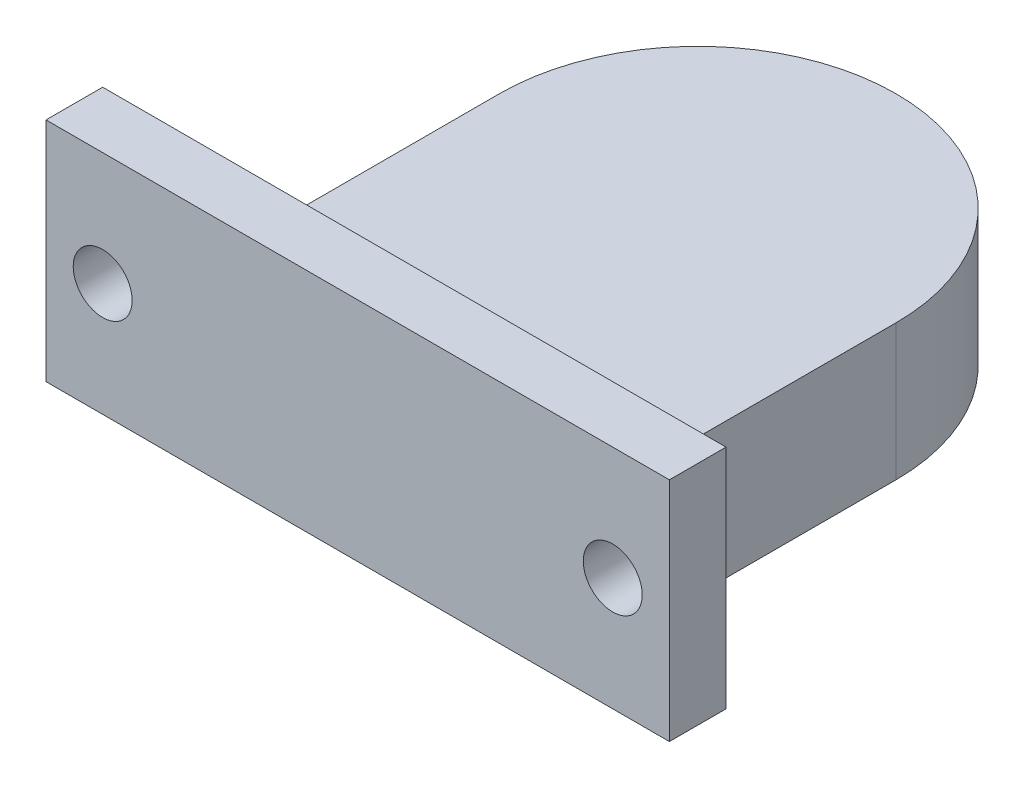
ISO-10303-21;
HEADER;
FILE_DESCRIPTION(('STEP AP214'),'2;1');
FILE_NAME('part.step','',(''),(''),'','','');
FILE_SCHEMA(('AUTOMOTIVE_DESIGN { 1 0 10303 214 1 1 1 1 }'));
ENDSEC;
DATA;
#1=APPLICATION_CONTEXT('core data for automotive mechanical design processes');
#2=APPLICATION_PROTOCOL_DEFINITION('international standard','automotive_design',2000,#1);
#3=PRODUCT_CONTEXT('',#1,'mechanical');
#4=PRODUCT('Part','Part','',(#3));
#5=PRODUCT_RELATED_PRODUCT_CATEGORY('part','',(#4));
#6=PRODUCT_DEFINITION_FORMATION('','',#4);
#7=PRODUCT_DEFINITION_CONTEXT('part definition',#1,'design');
#8=PRODUCT_DEFINITION('design','',#6,#7);
#9=PRODUCT_DEFINITION_SHAPE('','',#8);
#10=(LENGTH_UNIT() NAMED_UNIT(*) SI_UNIT(.MILLI.,.METRE.));
#11=(NAMED_UNIT(*) PLANE_ANGLE_UNIT() SI_UNIT($,.RADIAN.));
#12=(NAMED_UNIT(*) SI_UNIT($,.STERADIAN.) SOLID_ANGLE_UNIT());
#13=UNCERTAINTY_MEASURE_WITH_UNIT(LENGTH_MEASURE(1.E-05),#10,'distance_accuracy_value','');
#14=(GEOMETRIC_REPRESENTATION_CONTEXT(3) GLOBAL_UNCERTAINTY_ASSIGNED_CONTEXT((#13)) GLOBAL_UNIT_ASSIGNED_CONTEXT((#10,
#11,#12)) REPRESENTATION_CONTEXT('',''));
#15=CARTESIAN_POINT('',(0.,0.,0.));
#16=DIRECTION('',(0.,0.,1.));
#17=DIRECTION('',(1.,0.,0.));
#18=AXIS2_PLACEMENT_3D('',#15,#16,#17);
#19=CARTESIAN_POINT('',(-27.5,20.,25.));
#20=DIRECTION('',(0.,0.,1.));
#21=DIRECTION('',(1.,0.,0.));
#22=AXIS2_PLACEMENT_3D('',#19,#20,#21);
#23=PLANE('',#22);
#24=CARTESIAN_POINT('',(22.5,10.,25.));
#25=DIRECTION('',(0.,0.,-1.));
#26=DIRECTION('',(-1.,0.,0.));
#27=AXIS2_PLACEMENT_3D('',#24,#25,#26);
#28=CIRCLE('',#27,2.6);
#29=CARTESIAN_POINT('',(19.9,10.,25.));
#30=VERTEX_POINT('',#29);
#31=EDGE_CURVE('E245',#30,#30,#28,.T.);
#32=ORIENTED_EDGE('',*,*,#31,.F.);
#33=EDGE_LOOP('',(#32));
#34=FACE_BOUND('',#33,.T.);
#35=DIRECTION('',(0.,-1.,0.));
#36=VECTOR('',#35,1.);
#37=CARTESIAN_POINT('',(17.5,12.,25.));
#38=LINE('',#37,#36);
#39=CARTESIAN_POINT('',(17.5,20.,25.));
#40=VERTEX_POINT('',#39);
#41=CARTESIAN_POINT('',(17.5,0.,25.));
#42=VERTEX_POINT('',#41);
#43=EDGE_CURVE('E54',#40,#42,#38,.T.);
#44=ORIENTED_EDGE('',*,*,#43,.F.);
#45=DIRECTION('',(-1.,0.,0.));
#46=VECTOR('',#45,1.);
#47=CARTESIAN_POINT('',(-27.5,20.,25.));
#48=LINE('',#47,#46);
#49=CARTESIAN_POINT('',(27.5,20.,25.));
#50=VERTEX_POINT('',#49);
#51=EDGE_CURVE('E173',#50,#40,#48,.T.);
#52=ORIENTED_EDGE('',*,*,#51,.F.);
#53=DIRECTION('',(0.,-1.,0.));
#54=VECTOR('',#53,1.);
#55=CARTESIAN_POINT('',(27.5,20.,25.));
#56=LINE('',#55,#54);
#57=CARTESIAN_POINT('',(27.5,0.,25.));
#58=VERTEX_POINT('',#57);
#59=EDGE_CURVE('E133',#50,#58,#56,.T.);
#60=ORIENTED_EDGE('',*,*,#59,.T.);
#61=DIRECTION('',(-1.,0.,0.));
#62=VECTOR('',#61,1.);
#63=CARTESIAN_POINT('',(-27.5,0.,25.));
#64=LINE('',#63,#62);
#65=EDGE_CURVE('E123',#58,#42,#64,.T.);
#66=ORIENTED_EDGE('',*,*,#65,.T.);
#67=EDGE_LOOP('',(#44,#52,#60,#66));
#68=FACE_BOUND('',#67,.T.);
#69=ADVANCED_FACE('F32',(#34,#68),#23,.F.);
#70=CARTESIAN_POINT('',(0.,12.,0.));
#71=DIRECTION('',(0.,-1.,0.));
#72=DIRECTION('',(0.,0.,-1.));
#73=AXIS2_PLACEMENT_3D('',#70,#71,#72);
#74=CYLINDRICAL_SURFACE('',#73,11.1);
#75=CARTESIAN_POINT('',(0.,0.,0.));
#76=DIRECTION('',(0.,1.,0.));
#77=DIRECTION('',(0.,0.,1.));
#78=AXIS2_PLACEMENT_3D('',#75,#76,#77);
#79=CIRCLE('',#78,11.1);
#80=CARTESIAN_POINT('',(0.,0.,11.1));
#81=VERTEX_POINT('',#80);
#82=EDGE_CURVE('E131',#81,#81,#79,.T.);
#83=ORIENTED_EDGE('',*,*,#82,.F.);
#84=EDGE_LOOP('',(#83));
#85=FACE_BOUND('',#84,.T.);
#86=CARTESIAN_POINT('',(0.,10.,0.));
#87=DIRECTION('',(0.,1.,0.));
#88=DIRECTION('',(0.,0.,1.));
#89=AXIS2_PLACEMENT_3D('',#86,#87,#88);
#90=CIRCLE('',#89,11.1);
#91=CARTESIAN_POINT('',(0.,10.,11.1));
#92=VERTEX_POINT('',#91);
#93=EDGE_CURVE('E128',#92,#92,#90,.T.);
#94=ORIENTED_EDGE('',*,*,#93,.T.);
#95=EDGE_LOOP('',(#94));
#96=FACE_BOUND('',#95,.T.);
#97=ADVANCED_FACE('F219',(#85,#96),#74,.F.);
#98=CARTESIAN_POINT('',(0.,12.,0.));
#99=DIRECTION('',(0.,1.,0.));
#100=DIRECTION('',(0.,0.,1.));
#101=AXIS2_PLACEMENT_3D('',#98,#99,#100);
#102=PLANE('',#101);
#103=DIRECTION('',(0.,0.,1.));
#104=VECTOR('',#103,1.);
#105=CARTESIAN_POINT('',(-17.5,12.,0.));
#106=LINE('',#105,#104);
#107=CARTESIAN_POINT('',(-17.5,12.,0.));
#108=VERTEX_POINT('',#107);
#109=CARTESIAN_POINT('',(-17.5,12.,16.9999999999999));
#110=VERTEX_POINT('',#109);
#111=EDGE_CURVE('E143',#108,#110,#106,.T.);
#112=ORIENTED_EDGE('',*,*,#111,.T.);
#113=DIRECTION('',(1.,0.,0.));
#114=VECTOR('',#113,1.);
#115=CARTESIAN_POINT('',(0.,12.,16.9999999999999));
#116=LINE('',#115,#114);
#117=CARTESIAN_POINT('',(17.5,12.,16.9999999999999));
#118=VERTEX_POINT('',#117);
#119=EDGE_CURVE('E162',#110,#118,#116,.T.);
#120=ORIENTED_EDGE('',*,*,#119,.T.);
#121=DIRECTION('',(0.,0.,-1.));
#122=VECTOR('',#121,1.);
#123=CARTESIAN_POINT('',(17.5,12.,0.));
#124=LINE('',#123,#122);
#125=CARTESIAN_POINT('',(17.5,12.,0.));
#126=VERTEX_POINT('',#125);
#127=EDGE_CURVE('E147',#118,#126,#124,.T.);
#128=ORIENTED_EDGE('',*,*,#127,.T.);
#129=CARTESIAN_POINT('',(0.,12.,0.));
#130=DIRECTION('',(0.,1.,0.));
#131=DIRECTION('',(0.,0.,1.));
#132=AXIS2_PLACEMENT_3D('',#129,#130,#131);
#133=CIRCLE('',#132,17.5);
#134=EDGE_CURVE('E140',#126,#108,#133,.T.);
#135=ORIENTED_EDGE('',*,*,#134,.T.);
#136=EDGE_LOOP('',(#112,#120,#128,#135));
#137=FACE_BOUND('',#136,.T.);
#138=ADVANCED_FACE('F202',(#137),#102,.T.);
#139=CARTESIAN_POINT('',(0.,0.,0.));
#140=DIRECTION('',(0.,1.,0.));
#141=DIRECTION('',(0.,0.,1.));
#142=AXIS2_PLACEMENT_3D('',#139,#140,#141);
#143=PLANE('',#142);
#144=CARTESIAN_POINT('',(0.,0.,0.));
#145=DIRECTION('',(0.,1.,0.));
#146=DIRECTION('',(0.,0.,1.));
#147=AXIS2_PLACEMENT_3D('',#144,#145,#146);
#148=CIRCLE('',#147,17.5);
#149=CARTESIAN_POINT('',(17.5,0.,0.));
#150=VERTEX_POINT('',#149);
#151=CARTESIAN_POINT('',(-17.5,0.,0.));
#152=VERTEX_POINT('',#151);
#153=EDGE_CURVE('E139',#150,#152,#148,.T.);
#154=ORIENTED_EDGE('',*,*,#153,.F.);
#155=DIRECTION('',(0.,0.,-1.));
#156=VECTOR('',#155,1.);
#157=CARTESIAN_POINT('',(17.5,0.,0.));
#158=LINE('',#157,#156);
#159=EDGE_CURVE('E144',#42,#150,#158,.T.);
#160=ORIENTED_EDGE('',*,*,#159,.F.);
#161=ORIENTED_EDGE('',*,*,#65,.F.);
#162=DIRECTION('',(0.,0.,-1.));
#163=VECTOR('',#162,1.);
#164=CARTESIAN_POINT('',(27.5,0.,25.));
#165=LINE('',#164,#163);
#166=CARTESIAN_POINT('',(27.5,0.,30.));
#167=VERTEX_POINT('',#166);
#168=EDGE_CURVE('E186',#167,#58,#165,.T.);
#169=ORIENTED_EDGE('',*,*,#168,.F.);
#170=DIRECTION('',(1.,0.,0.));
#171=VECTOR('',#170,1.);
#172=CARTESIAN_POINT('',(-27.5,0.,30.));
#173=LINE('',#172,#171);
#174=CARTESIAN_POINT('',(-27.5,0.,30.));
#175=VERTEX_POINT('',#174);
#176=EDGE_CURVE('E183',#175,#167,#173,.T.);
#177=ORIENTED_EDGE('',*,*,#176,.F.);
#178=DIRECTION('',(0.,0.,1.));
#179=VECTOR('',#178,1.);
#180=CARTESIAN_POINT('',(-27.5,0.,25.));
#181=LINE('',#180,#179);
#182=CARTESIAN_POINT('',(-27.5,0.,25.));
#183=VERTEX_POINT('',#182);
#184=EDGE_CURVE('E127',#183,#175,#181,.T.);
#185=ORIENTED_EDGE('',*,*,#184,.F.);
#186=CARTESIAN_POINT('',(-17.5,0.,25.));
#187=VERTEX_POINT('',#186);
#188=EDGE_CURVE('E188',#187,#183,#64,.T.);
#189=ORIENTED_EDGE('',*,*,#188,.F.);
#190=DIRECTION('',(0.,0.,1.));
#191=VECTOR('',#190,1.);
#192=CARTESIAN_POINT('',(-17.5,0.,0.));
#193=LINE('',#192,#191);
#194=EDGE_CURVE('E152',#152,#187,#193,.T.);
#195=ORIENTED_EDGE('',*,*,#194,.F.);
#196=EDGE_LOOP('',(#154,#160,#161,#169,#177,#185,#189,#195));
#197=FACE_BOUND('',#196,.T.);
#198=ORIENTED_EDGE('',*,*,#82,.T.);
#199=EDGE_LOOP('',(#198));
#200=FACE_BOUND('',#199,.T.);
#201=ADVANCED_FACE('F195',(#197,#200),#143,.F.);
#202=CARTESIAN_POINT('',(0.,12.,0.));
#203=DIRECTION('',(0.,-1.,0.));
#204=DIRECTION('',(0.,0.,-1.));
#205=AXIS2_PLACEMENT_3D('',#202,#203,#204);
#206=CYLINDRICAL_SURFACE('',#205,17.5);
#207=ORIENTED_EDGE('',*,*,#153,.T.);
#208=DIRECTION('',(0.,-1.,0.));
#209=VECTOR('',#208,1.);
#210=CARTESIAN_POINT('',(-17.5,12.,0.));
#211=LINE('',#210,#209);
#212=EDGE_CURVE('E159',#108,#152,#211,.T.);
#213=ORIENTED_EDGE('',*,*,#212,.F.);
#214=ORIENTED_EDGE('',*,*,#134,.F.);
#215=DIRECTION('',(0.,-1.,0.));
#216=VECTOR('',#215,1.);
#217=CARTESIAN_POINT('',(17.5,12.,0.));
#218=LINE('',#217,#216);
#219=EDGE_CURVE('E149',#126,#150,#218,.T.);
#220=ORIENTED_EDGE('',*,*,#219,.T.);
#221=EDGE_LOOP('',(#207,#213,#214,#220));
#222=FACE_BOUND('',#221,.T.);
#223=ADVANCED_FACE('F199',(#222),#206,.T.);
#224=CARTESIAN_POINT('',(-17.5,12.,0.));
#225=DIRECTION('',(1.,0.,0.));
#226=DIRECTION('',(0.,0.,-1.));
#227=AXIS2_PLACEMENT_3D('',#224,#225,#226);
#228=PLANE('',#227);
#229=ORIENTED_EDGE('',*,*,#194,.T.);
#230=DIRECTION('',(0.,-1.,0.));
#231=VECTOR('',#230,1.);
#232=CARTESIAN_POINT('',(-17.5,12.,25.));
#233=LINE('',#232,#231);
#234=CARTESIAN_POINT('',(-17.5,20.,25.));
#235=VERTEX_POINT('',#234);
#236=EDGE_CURVE('E46',#235,#187,#233,.T.);
#237=ORIENTED_EDGE('',*,*,#236,.F.);
#238=DIRECTION('',(0.,-0.707106781186544,-0.707106781186551));
#239=VECTOR('',#238,1.);
#240=CARTESIAN_POINT('',(-17.5,3.50000000000004,8.49999999999988));
#241=LINE('',#240,#239);
#242=EDGE_CURVE('E11',#235,#110,#241,.T.);
#243=ORIENTED_EDGE('',*,*,#242,.T.);
#244=ORIENTED_EDGE('',*,*,#111,.F.);
#245=ORIENTED_EDGE('',*,*,#212,.T.);
#246=EDGE_LOOP('',(#229,#237,#243,#244,#245));
#247=FACE_BOUND('',#246,.T.);
#248=ADVANCED_FACE('F203',(#247),#228,.F.);
#249=CARTESIAN_POINT('',(17.5,12.,0.));
#250=DIRECTION('',(-1.,0.,0.));
#251=DIRECTION('',(0.,0.,1.));
#252=AXIS2_PLACEMENT_3D('',#249,#250,#251);
#253=PLANE('',#252);
#254=ORIENTED_EDGE('',*,*,#159,.T.);
#255=ORIENTED_EDGE('',*,*,#219,.F.);
#256=ORIENTED_EDGE('',*,*,#127,.F.);
#257=DIRECTION('',(0.,0.707106781186544,0.707106781186551));
#258=VECTOR('',#257,1.);
#259=CARTESIAN_POINT('',(17.5,3.50000000000004,8.49999999999988));
#260=LINE('',#259,#258);
#261=EDGE_CURVE('E40',#118,#40,#260,.T.);
#262=ORIENTED_EDGE('',*,*,#261,.T.);
#263=ORIENTED_EDGE('',*,*,#43,.T.);
#264=EDGE_LOOP('',(#254,#255,#256,#262,#263));
#265=FACE_BOUND('',#264,.T.);
#266=ADVANCED_FACE('F167',(#265),#253,.F.);
#267=CARTESIAN_POINT('',(0.,10.,0.));
#268=DIRECTION('',(0.,1.,0.));
#269=DIRECTION('',(0.,0.,1.));
#270=AXIS2_PLACEMENT_3D('',#267,#268,#269);
#271=PLANE('',#270);
#272=ORIENTED_EDGE('',*,*,#93,.F.);
#273=EDGE_LOOP('',(#272));
#274=FACE_BOUND('',#273,.T.);
#275=ADVANCED_FACE('F283',(#274),#271,.F.);
#276=CARTESIAN_POINT('',(-27.5,20.,25.));
#277=DIRECTION('',(1.,0.,0.));
#278=DIRECTION('',(0.,0.,-1.));
#279=AXIS2_PLACEMENT_3D('',#276,#277,#278);
#280=PLANE('',#279);
#281=ORIENTED_EDGE('',*,*,#184,.T.);
#282=DIRECTION('',(0.,-1.,0.));
#283=VECTOR('',#282,1.);
#284=CARTESIAN_POINT('',(-27.5,20.,30.));
#285=LINE('',#284,#283);
#286=CARTESIAN_POINT('',(-27.5,20.,30.));
#287=VERTEX_POINT('',#286);
#288=EDGE_CURVE('E107',#287,#175,#285,.T.);
#289=ORIENTED_EDGE('',*,*,#288,.F.);
#290=DIRECTION('',(0.,0.,1.));
#291=VECTOR('',#290,1.);
#292=CARTESIAN_POINT('',(-27.5,20.,25.));
#293=LINE('',#292,#291);
#294=CARTESIAN_POINT('',(-27.5,20.,25.));
#295=VERTEX_POINT('',#294);
#296=EDGE_CURVE('E114',#295,#287,#293,.T.);
#297=ORIENTED_EDGE('',*,*,#296,.F.);
#298=DIRECTION('',(0.,-1.,0.));
#299=VECTOR('',#298,1.);
#300=CARTESIAN_POINT('',(-27.5,20.,25.));
#301=LINE('',#300,#299);
#302=EDGE_CURVE('E178',#295,#183,#301,.T.);
#303=ORIENTED_EDGE('',*,*,#302,.T.);
#304=EDGE_LOOP('',(#281,#289,#297,#303));
#305=FACE_BOUND('',#304,.T.);
#306=ADVANCED_FACE('F125',(#305),#280,.F.);
#307=CARTESIAN_POINT('',(-27.5,20.,30.));
#308=DIRECTION('',(0.,0.,-1.));
#309=DIRECTION('',(-1.,0.,0.));
#310=AXIS2_PLACEMENT_3D('',#307,#308,#309);
#311=PLANE('',#310);
#312=CARTESIAN_POINT('',(22.5,10.,30.));
#313=DIRECTION('',(0.,0.,-1.));
#314=DIRECTION('',(-1.,0.,0.));
#315=AXIS2_PLACEMENT_3D('',#312,#313,#314);
#316=CIRCLE('',#315,2.6);
#317=CARTESIAN_POINT('',(19.9,10.,30.));
#318=VERTEX_POINT('',#317);
#319=EDGE_CURVE('E243',#318,#318,#316,.T.);
#320=ORIENTED_EDGE('',*,*,#319,.T.);
#321=EDGE_LOOP('',(#320));
#322=FACE_BOUND('',#321,.T.);
#323=CARTESIAN_POINT('',(-22.5,10.,30.));
#324=DIRECTION('',(0.,0.,-1.));
#325=DIRECTION('',(-1.,0.,0.));
#326=AXIS2_PLACEMENT_3D('',#323,#324,#325);
#327=CIRCLE('',#326,2.6);
#328=CARTESIAN_POINT('',(-25.1,10.,30.));
#329=VERTEX_POINT('',#328);
#330=EDGE_CURVE('E184',#329,#329,#327,.T.);
#331=ORIENTED_EDGE('',*,*,#330,.T.);
#332=EDGE_LOOP('',(#331));
#333=FACE_BOUND('',#332,.T.);
#334=ORIENTED_EDGE('',*,*,#176,.T.);
#335=DIRECTION('',(0.,-1.,0.));
#336=VECTOR('',#335,1.);
#337=CARTESIAN_POINT('',(27.5,20.,30.));
#338=LINE('',#337,#336);
#339=CARTESIAN_POINT('',(27.5,20.,30.));
#340=VERTEX_POINT('',#339);
#341=EDGE_CURVE('E110',#340,#167,#338,.T.);
#342=ORIENTED_EDGE('',*,*,#341,.F.);
#343=DIRECTION('',(1.,0.,0.));
#344=VECTOR('',#343,1.);
#345=CARTESIAN_POINT('',(-27.5,20.,30.));
#346=LINE('',#345,#344);
#347=EDGE_CURVE('E103',#287,#340,#346,.T.);
#348=ORIENTED_EDGE('',*,*,#347,.F.);
#349=ORIENTED_EDGE('',*,*,#288,.T.);
#350=EDGE_LOOP('',(#334,#342,#348,#349));
#351=FACE_BOUND('',#350,.T.);
#352=ADVANCED_FACE('F105',(#322,#333,#351),#311,.F.);
#353=CARTESIAN_POINT('',(27.5,20.,25.));
#354=DIRECTION('',(-1.,0.,0.));
#355=DIRECTION('',(0.,0.,1.));
#356=AXIS2_PLACEMENT_3D('',#353,#354,#355);
#357=PLANE('',#356);
#358=ORIENTED_EDGE('',*,*,#168,.T.);
#359=ORIENTED_EDGE('',*,*,#59,.F.);
#360=DIRECTION('',(0.,0.,-1.));
#361=VECTOR('',#360,1.);
#362=CARTESIAN_POINT('',(27.5,20.,25.));
#363=LINE('',#362,#361);
#364=EDGE_CURVE('E113',#340,#50,#363,.T.);
#365=ORIENTED_EDGE('',*,*,#364,.F.);
#366=ORIENTED_EDGE('',*,*,#341,.T.);
#367=EDGE_LOOP('',(#358,#359,#365,#366));
#368=FACE_BOUND('',#367,.T.);
#369=ADVANCED_FACE('F207',(#368),#357,.F.);
#370=CARTESIAN_POINT('',(-22.5,10.,25.));
#371=DIRECTION('',(0.,0.,-1.));
#372=DIRECTION('',(-1.,0.,0.));
#373=AXIS2_PLACEMENT_3D('',#370,#371,#372);
#374=CIRCLE('',#373,2.6);
#375=CARTESIAN_POINT('',(-25.1,10.,25.));
#376=VERTEX_POINT('',#375);
#377=EDGE_CURVE('E247',#376,#376,#374,.T.);
#378=ORIENTED_EDGE('',*,*,#377,.F.);
#379=EDGE_LOOP('',(#378));
#380=FACE_BOUND('',#379,.T.);
#381=EDGE_CURVE('E119',#235,#295,#48,.T.);
#382=ORIENTED_EDGE('',*,*,#381,.F.);
#383=ORIENTED_EDGE('',*,*,#236,.T.);
#384=ORIENTED_EDGE('',*,*,#188,.T.);
#385=ORIENTED_EDGE('',*,*,#302,.F.);
#386=EDGE_LOOP('',(#382,#383,#384,#385));
#387=FACE_BOUND('',#386,.T.);
#388=ADVANCED_FACE('F206',(#380,#387),#23,.F.);
#389=CARTESIAN_POINT('',(0.,20.,0.));
#390=DIRECTION('',(0.,1.,0.));
#391=DIRECTION('',(0.,0.,1.));
#392=AXIS2_PLACEMENT_3D('',#389,#390,#391);
#393=PLANE('',#392);
#394=ORIENTED_EDGE('',*,*,#296,.T.);
#395=ORIENTED_EDGE('',*,*,#347,.T.);
#396=ORIENTED_EDGE('',*,*,#364,.T.);
#397=ORIENTED_EDGE('',*,*,#51,.T.);
#398=EDGE_CURVE('E174',#40,#235,#48,.T.);
#399=ORIENTED_EDGE('',*,*,#398,.T.);
#400=ORIENTED_EDGE('',*,*,#381,.T.);
#401=EDGE_LOOP('',(#394,#395,#396,#397,#399,#400));
#402=FACE_BOUND('',#401,.T.);
#403=ADVANCED_FACE('F117',(#402),#393,.T.);
#404=CARTESIAN_POINT('',(-22.5,10.,30.));
#405=DIRECTION('',(0.,0.,-1.));
#406=DIRECTION('',(-1.,0.,0.));
#407=AXIS2_PLACEMENT_3D('',#404,#405,#406);
#408=CYLINDRICAL_SURFACE('',#407,2.6);
#409=ORIENTED_EDGE('',*,*,#330,.F.);
#410=EDGE_LOOP('',(#409));
#411=FACE_BOUND('',#410,.T.);
#412=ORIENTED_EDGE('',*,*,#377,.T.);
#413=EDGE_LOOP('',(#412));
#414=FACE_BOUND('',#413,.T.);
#415=ADVANCED_FACE('F230',(#411,#414),#408,.F.);
#416=CARTESIAN_POINT('',(22.5,10.,30.));
#417=DIRECTION('',(0.,0.,-1.));
#418=DIRECTION('',(-1.,0.,0.));
#419=AXIS2_PLACEMENT_3D('',#416,#417,#418);
#420=CYLINDRICAL_SURFACE('',#419,2.6);
#421=ORIENTED_EDGE('',*,*,#319,.F.);
#422=EDGE_LOOP('',(#421));
#423=FACE_BOUND('',#422,.T.);
#424=ORIENTED_EDGE('',*,*,#31,.T.);
#425=EDGE_LOOP('',(#424));
#426=FACE_BOUND('',#425,.T.);
#427=ADVANCED_FACE('F233',(#423,#426),#420,.F.);
#428=CARTESIAN_POINT('',(0.,12.,16.9999999999999));
#429=DIRECTION('',(0.,-0.707106781186551,0.707106781186544));
#430=DIRECTION('',(1.,0.,0.));
#431=AXIS2_PLACEMENT_3D('',#428,#429,#430);
#432=PLANE('',#431);
#433=ORIENTED_EDGE('',*,*,#242,.F.);
#434=ORIENTED_EDGE('',*,*,#398,.F.);
#435=ORIENTED_EDGE('',*,*,#261,.F.);
#436=ORIENTED_EDGE('',*,*,#119,.F.);
#437=EDGE_LOOP('',(#433,#434,#435,#436));
#438=FACE_BOUND('',#437,.T.);
#439=ADVANCED_FACE('F34',(#438),#432,.F.);
#440=CLOSED_SHELL('',(#69,#97,#138,#201,#223,#248,#266,#275,#306,#352,#369,#388,#403,#415,#427,#439));
#441=MANIFOLD_SOLID_BREP('B2',#440);
#442=ADVANCED_BREP_SHAPE_REPRESENTATION('',(#18,#441),#14);
#443=SHAPE_DEFINITION_REPRESENTATION(#9,#442);
ENDSEC;
END-ISO-10303-21;
